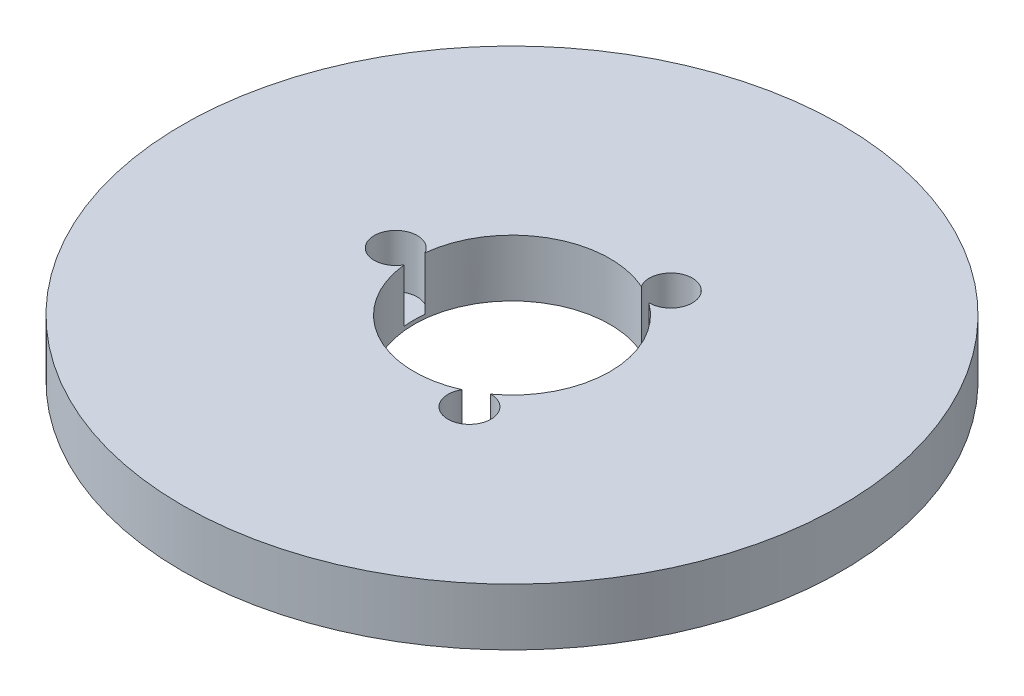
ISO-10303-21;
HEADER;
FILE_DESCRIPTION(('STEP AP214'),'2;1');
FILE_NAME('part.step','',(''),(''),'','','');
FILE_SCHEMA(('AUTOMOTIVE_DESIGN { 1 0 10303 214 1 1 1 1 }'));
ENDSEC;
DATA;
#1=APPLICATION_CONTEXT('core data for automotive mechanical design processes');
#2=APPLICATION_PROTOCOL_DEFINITION('international standard','automotive_design',2000,#1);
#3=PRODUCT_CONTEXT('',#1,'mechanical');
#4=PRODUCT('Part','Part','',(#3));
#5=PRODUCT_RELATED_PRODUCT_CATEGORY('part','',(#4));
#6=PRODUCT_DEFINITION_FORMATION('','',#4);
#7=PRODUCT_DEFINITION_CONTEXT('part definition',#1,'design');
#8=PRODUCT_DEFINITION('design','',#6,#7);
#9=PRODUCT_DEFINITION_SHAPE('','',#8);
#10=(LENGTH_UNIT() NAMED_UNIT(*) SI_UNIT(.MILLI.,.METRE.));
#11=(NAMED_UNIT(*) PLANE_ANGLE_UNIT() SI_UNIT($,.RADIAN.));
#12=(NAMED_UNIT(*) SI_UNIT($,.STERADIAN.) SOLID_ANGLE_UNIT());
#13=UNCERTAINTY_MEASURE_WITH_UNIT(LENGTH_MEASURE(1.E-05),#10,'distance_accuracy_value','');
#14=(GEOMETRIC_REPRESENTATION_CONTEXT(3) GLOBAL_UNCERTAINTY_ASSIGNED_CONTEXT((#13)) GLOBAL_UNIT_ASSIGNED_CONTEXT((#10,
#11,#12)) REPRESENTATION_CONTEXT('',''));
#15=CARTESIAN_POINT('',(0.,0.,0.));
#16=DIRECTION('',(0.,0.,1.));
#17=DIRECTION('',(1.,0.,0.));
#18=AXIS2_PLACEMENT_3D('',#15,#16,#17);
#19=CARTESIAN_POINT('',(0.,16.,0.));
#20=DIRECTION('',(0.,-1.,0.));
#21=DIRECTION('',(0.,0.,-1.));
#22=AXIS2_PLACEMENT_3D('',#19,#20,#21);
#23=CYLINDRICAL_SURFACE('',#22,92.5);
#24=CARTESIAN_POINT('',(0.,16.,0.));
#25=DIRECTION('',(0.,1.,0.));
#26=DIRECTION('',(0.,0.,1.));
#27=AXIS2_PLACEMENT_3D('',#24,#25,#26);
#28=CIRCLE('',#27,92.5);
#29=CARTESIAN_POINT('',(0.,16.,92.5));
#30=VERTEX_POINT('',#29);
#31=EDGE_CURVE('E126',#30,#30,#28,.T.);
#32=ORIENTED_EDGE('',*,*,#31,.F.);
#33=EDGE_LOOP('',(#32));
#34=FACE_BOUND('',#33,.T.);
#35=CARTESIAN_POINT('',(0.,0.,0.));
#36=DIRECTION('',(0.,1.,0.));
#37=DIRECTION('',(0.,0.,1.));
#38=AXIS2_PLACEMENT_3D('',#35,#36,#37);
#39=CIRCLE('',#38,92.5);
#40=CARTESIAN_POINT('',(0.,0.,92.5));
#41=VERTEX_POINT('',#40);
#42=EDGE_CURVE('E124',#41,#41,#39,.T.);
#43=ORIENTED_EDGE('',*,*,#42,.T.);
#44=EDGE_LOOP('',(#43));
#45=FACE_BOUND('',#44,.T.);
#46=ADVANCED_FACE('F39',(#34,#45),#23,.T.);
#47=CARTESIAN_POINT('',(0.,16.,0.));
#48=DIRECTION('',(0.,1.,0.));
#49=DIRECTION('',(0.,0.,1.));
#50=AXIS2_PLACEMENT_3D('',#47,#48,#49);
#51=PLANE('',#50);
#52=CARTESIAN_POINT('',(16.3174792293362,16.,28.2627030766599));
#53=DIRECTION('',(0.,1.,0.));
#54=DIRECTION('',(0.866025403784436,0.,-0.500000000000004));
#55=AXIS2_PLACEMENT_3D('',#52,#53,#54);
#56=CIRCLE('',#55,6.04727250579016);
#57=CARTESIAN_POINT('',(11.1362899057225,16.,25.1442448114017));
#58=VERTEX_POINT('',#57);
#59=CARTESIAN_POINT('',(16.2074098127879,16.,22.2164323679646));
#60=VERTEX_POINT('',#59);
#61=EDGE_CURVE('E147',#58,#60,#56,.T.);
#62=ORIENTED_EDGE('',*,*,#61,.F.);
#63=CARTESIAN_POINT('',(0.,16.,0.));
#64=DIRECTION('',(0.,1.,0.));
#65=DIRECTION('',(0.,0.,1.));
#66=AXIS2_PLACEMENT_3D('',#63,#64,#65);
#67=CIRCLE('',#66,27.5);
#68=CARTESIAN_POINT('',(-27.3436997185102,16.,2.92781244343707));
#69=VERTEX_POINT('',#68);
#70=EDGE_CURVE('E118',#69,#58,#67,.T.);
#71=ORIENTED_EDGE('',*,*,#70,.F.);
#72=CARTESIAN_POINT('',(-32.6349584586722,16.,0.));
#73=DIRECTION('',(0.,1.,0.));
#74=DIRECTION('',(0.,0.,1.));
#75=AXIS2_PLACEMENT_3D('',#72,#73,#74);
#76=CIRCLE('',#75,6.04727250579016);
#77=CARTESIAN_POINT('',(-27.3436997185102,16.,-2.92781244343707));
#78=VERTEX_POINT('',#77);
#79=EDGE_CURVE('E113',#78,#69,#76,.T.);
#80=ORIENTED_EDGE('',*,*,#79,.F.);
#81=CARTESIAN_POINT('',(11.1362899057222,16.,-25.1442448114019));
#82=VERTEX_POINT('',#81);
#83=EDGE_CURVE('E106',#82,#78,#67,.T.);
#84=ORIENTED_EDGE('',*,*,#83,.F.);
#85=CARTESIAN_POINT('',(16.3174792293358,16.,-28.2627030766601));
#86=DIRECTION('',(0.,1.,0.));
#87=DIRECTION('',(-0.866025403784443,0.,-0.499999999999992));
#88=AXIS2_PLACEMENT_3D('',#85,#86,#87);
#89=CIRCLE('',#88,6.04727250579016);
#90=CARTESIAN_POINT('',(16.2074098127876,16.,-22.2164323679649));
#91=VERTEX_POINT('',#90);
#92=EDGE_CURVE('E90',#91,#82,#89,.T.);
#93=ORIENTED_EDGE('',*,*,#92,.F.);
#94=EDGE_CURVE('E116',#60,#91,#67,.T.);
#95=ORIENTED_EDGE('',*,*,#94,.F.);
#96=EDGE_LOOP('',(#62,#71,#80,#84,#93,#95));
#97=FACE_BOUND('',#96,.T.);
#98=ORIENTED_EDGE('',*,*,#31,.T.);
#99=EDGE_LOOP('',(#98));
#100=FACE_BOUND('',#99,.T.);
#101=ADVANCED_FACE('F115',(#97,#100),#51,.T.);
#102=CARTESIAN_POINT('',(0.,0.,0.));
#103=DIRECTION('',(0.,1.,0.));
#104=DIRECTION('',(0.,0.,1.));
#105=AXIS2_PLACEMENT_3D('',#102,#103,#104);
#106=PLANE('',#105);
#107=CARTESIAN_POINT('',(0.,0.,0.));
#108=DIRECTION('',(0.,1.,0.));
#109=DIRECTION('',(0.,0.,1.));
#110=AXIS2_PLACEMENT_3D('',#107,#108,#109);
#111=CIRCLE('',#110,27.5);
#112=CARTESIAN_POINT('',(0.,0.,27.5));
#113=VERTEX_POINT('',#112);
#114=EDGE_CURVE('E120',#113,#113,#111,.T.);
#115=ORIENTED_EDGE('',*,*,#114,.T.);
#116=EDGE_LOOP('',(#115));
#117=FACE_BOUND('',#116,.T.);
#118=ORIENTED_EDGE('',*,*,#42,.F.);
#119=EDGE_LOOP('',(#118));
#120=FACE_BOUND('',#119,.T.);
#121=ADVANCED_FACE('F164',(#117,#120),#106,.F.);
#122=CARTESIAN_POINT('',(0.,16.,0.));
#123=DIRECTION('',(0.,-1.,0.));
#124=DIRECTION('',(0.,0.,-1.));
#125=AXIS2_PLACEMENT_3D('',#122,#123,#124);
#126=CYLINDRICAL_SURFACE('',#125,27.5);
#127=DIRECTION('',(0.,1.,0.));
#128=VECTOR('',#127,1.);
#129=CARTESIAN_POINT('',(11.1362899057225,8.53697431034146,25.1442448114017));
#130=LINE('',#129,#128);
#131=CARTESIAN_POINT('',(11.1362899057225,1.07394862068291,25.1442448114017));
#132=VERTEX_POINT('',#131);
#133=EDGE_CURVE('E11',#132,#58,#130,.T.);
#134=ORIENTED_EDGE('',*,*,#133,.F.);
#135=CARTESIAN_POINT('',(0.,1.07394862068291,0.));
#136=DIRECTION('',(0.,1.,0.));
#137=DIRECTION('',(0.,0.,1.));
#138=AXIS2_PLACEMENT_3D('',#135,#136,#137);
#139=CIRCLE('',#138,27.5);
#140=CARTESIAN_POINT('',(16.2074098127879,1.07394862068291,22.2164323679646));
#141=VERTEX_POINT('',#140);
#142=EDGE_CURVE('E144',#132,#141,#139,.T.);
#143=ORIENTED_EDGE('',*,*,#142,.T.);
#144=DIRECTION('',(0.,1.,0.));
#145=VECTOR('',#144,1.);
#146=CARTESIAN_POINT('',(16.2074098127879,8.53697431034146,22.2164323679646));
#147=LINE('',#146,#145);
#148=EDGE_CURVE('E46',#60,#141,#147,.F.);
#149=ORIENTED_EDGE('',*,*,#148,.F.);
#150=ORIENTED_EDGE('',*,*,#94,.T.);
#151=DIRECTION('',(0.,1.,0.));
#152=VECTOR('',#151,1.);
#153=CARTESIAN_POINT('',(16.2074098127876,8.53697431034146,-22.2164323679649));
#154=LINE('',#153,#152);
#155=CARTESIAN_POINT('',(16.2074098127876,1.07394862068291,-22.2164323679649));
#156=VERTEX_POINT('',#155);
#157=EDGE_CURVE('E92',#156,#91,#154,.T.);
#158=ORIENTED_EDGE('',*,*,#157,.F.);
#159=CARTESIAN_POINT('',(0.,1.07394862068291,0.));
#160=DIRECTION('',(0.,1.,0.));
#161=DIRECTION('',(0.,0.,1.));
#162=AXIS2_PLACEMENT_3D('',#159,#160,#161);
#163=CIRCLE('',#162,27.5);
#164=CARTESIAN_POINT('',(11.1362899057222,1.07394862068291,-25.1442448114019));
#165=VERTEX_POINT('',#164);
#166=EDGE_CURVE('E107',#156,#165,#163,.T.);
#167=ORIENTED_EDGE('',*,*,#166,.T.);
#168=DIRECTION('',(0.,1.,0.));
#169=VECTOR('',#168,1.);
#170=CARTESIAN_POINT('',(11.1362899057222,8.53697431034146,-25.1442448114019));
#171=LINE('',#170,#169);
#172=EDGE_CURVE('E95',#82,#165,#171,.F.);
#173=ORIENTED_EDGE('',*,*,#172,.F.);
#174=ORIENTED_EDGE('',*,*,#83,.T.);
#175=DIRECTION('',(0.,1.,0.));
#176=VECTOR('',#175,1.);
#177=CARTESIAN_POINT('',(-27.3436997185102,8.53697431034146,-2.92781244343707));
#178=LINE('',#177,#176);
#179=CARTESIAN_POINT('',(-27.3436997185102,1.07394862068291,-2.92781244343707));
#180=VERTEX_POINT('',#179);
#181=EDGE_CURVE('E143',#180,#78,#178,.T.);
#182=ORIENTED_EDGE('',*,*,#181,.F.);
#183=CARTESIAN_POINT('',(0.,1.07394862068291,0.));
#184=DIRECTION('',(0.,1.,0.));
#185=DIRECTION('',(0.,0.,1.));
#186=AXIS2_PLACEMENT_3D('',#183,#184,#185);
#187=CIRCLE('',#186,27.5);
#188=CARTESIAN_POINT('',(-27.3436997185102,1.07394862068291,2.92781244343707));
#189=VERTEX_POINT('',#188);
#190=EDGE_CURVE('E132',#180,#189,#187,.T.);
#191=ORIENTED_EDGE('',*,*,#190,.T.);
#192=DIRECTION('',(0.,1.,0.));
#193=VECTOR('',#192,1.);
#194=CARTESIAN_POINT('',(-27.3436997185102,8.53697431034146,2.92781244343707));
#195=LINE('',#194,#193);
#196=EDGE_CURVE('E137',#69,#189,#195,.F.);
#197=ORIENTED_EDGE('',*,*,#196,.F.);
#198=ORIENTED_EDGE('',*,*,#70,.T.);
#199=EDGE_LOOP('',(#134,#143,#149,#150,#158,#167,#173,#174,#182,#191,#197,#198));
#200=FACE_BOUND('',#199,.T.);
#201=ORIENTED_EDGE('',*,*,#114,.F.);
#202=EDGE_LOOP('',(#201));
#203=FACE_BOUND('',#202,.T.);
#204=ADVANCED_FACE('F103',(#200,#203),#126,.F.);
#205=CARTESIAN_POINT('',(-32.6349584586722,1.07394862068291,0.));
#206=DIRECTION('',(0.,1.,0.));
#207=DIRECTION('',(0.,0.,1.));
#208=AXIS2_PLACEMENT_3D('',#205,#206,#207);
#209=CYLINDRICAL_SURFACE('',#208,6.04727250579016);
#210=ORIENTED_EDGE('',*,*,#181,.T.);
#211=ORIENTED_EDGE('',*,*,#79,.T.);
#212=ORIENTED_EDGE('',*,*,#196,.T.);
#213=CARTESIAN_POINT('',(-32.6349584586722,1.07394862068291,0.));
#214=DIRECTION('',(0.,1.,0.));
#215=DIRECTION('',(0.,0.,1.));
#216=AXIS2_PLACEMENT_3D('',#213,#214,#215);
#217=CIRCLE('',#216,6.04727250579016);
#218=EDGE_CURVE('E121',#180,#189,#217,.T.);
#219=ORIENTED_EDGE('',*,*,#218,.F.);
#220=EDGE_LOOP('',(#210,#211,#212,#219));
#221=FACE_BOUND('',#220,.T.);
#222=ADVANCED_FACE('F174',(#221),#209,.F.);
#223=CARTESIAN_POINT('',(-32.6349584586722,1.07394862068291,0.));
#224=DIRECTION('',(0.,1.,0.));
#225=DIRECTION('',(0.,0.,1.));
#226=AXIS2_PLACEMENT_3D('',#223,#224,#225);
#227=PLANE('',#226);
#228=ORIENTED_EDGE('',*,*,#218,.T.);
#229=ORIENTED_EDGE('',*,*,#190,.F.);
#230=EDGE_LOOP('',(#228,#229));
#231=FACE_BOUND('',#230,.T.);
#232=ADVANCED_FACE('F177',(#231),#227,.T.);
#233=CARTESIAN_POINT('',(16.3174792293358,1.07394862068291,-28.2627030766601));
#234=DIRECTION('',(0.,1.,0.));
#235=DIRECTION('',(0.,0.,1.));
#236=AXIS2_PLACEMENT_3D('',#233,#234,#235);
#237=CYLINDRICAL_SURFACE('',#236,6.04727250579016);
#238=ORIENTED_EDGE('',*,*,#157,.T.);
#239=ORIENTED_EDGE('',*,*,#92,.T.);
#240=ORIENTED_EDGE('',*,*,#172,.T.);
#241=CARTESIAN_POINT('',(16.3174792293358,1.07394862068291,-28.2627030766601));
#242=DIRECTION('',(0.,1.,0.));
#243=DIRECTION('',(-0.866025403784443,0.,-0.499999999999992));
#244=AXIS2_PLACEMENT_3D('',#241,#242,#243);
#245=CIRCLE('',#244,6.04727250579016);
#246=EDGE_CURVE('E56',#156,#165,#245,.T.);
#247=ORIENTED_EDGE('',*,*,#246,.F.);
#248=EDGE_LOOP('',(#238,#239,#240,#247));
#249=FACE_BOUND('',#248,.T.);
#250=ADVANCED_FACE('F93',(#249),#237,.F.);
#251=CARTESIAN_POINT('',(16.3174792293358,1.07394862068291,-28.2627030766601));
#252=DIRECTION('',(0.,1.,0.));
#253=DIRECTION('',(-0.866025403784443,0.,-0.499999999999992));
#254=AXIS2_PLACEMENT_3D('',#251,#252,#253);
#255=PLANE('',#254);
#256=ORIENTED_EDGE('',*,*,#246,.T.);
#257=ORIENTED_EDGE('',*,*,#166,.F.);
#258=EDGE_LOOP('',(#256,#257));
#259=FACE_BOUND('',#258,.T.);
#260=ADVANCED_FACE('F160',(#259),#255,.T.);
#261=CARTESIAN_POINT('',(16.3174792293362,1.07394862068291,28.2627030766599));
#262=DIRECTION('',(0.,1.,0.));
#263=DIRECTION('',(0.,0.,1.));
#264=AXIS2_PLACEMENT_3D('',#261,#262,#263);
#265=CYLINDRICAL_SURFACE('',#264,6.04727250579016);
#266=ORIENTED_EDGE('',*,*,#133,.T.);
#267=ORIENTED_EDGE('',*,*,#61,.T.);
#268=ORIENTED_EDGE('',*,*,#148,.T.);
#269=CARTESIAN_POINT('',(16.3174792293362,1.07394862068291,28.2627030766599));
#270=DIRECTION('',(0.,1.,0.));
#271=DIRECTION('',(0.866025403784436,0.,-0.500000000000004));
#272=AXIS2_PLACEMENT_3D('',#269,#270,#271);
#273=CIRCLE('',#272,6.04727250579016);
#274=EDGE_CURVE('E55',#132,#141,#273,.T.);
#275=ORIENTED_EDGE('',*,*,#274,.F.);
#276=EDGE_LOOP('',(#266,#267,#268,#275));
#277=FACE_BOUND('',#276,.T.);
#278=ADVANCED_FACE('F149',(#277),#265,.F.);
#279=CARTESIAN_POINT('',(16.3174792293362,1.07394862068291,28.2627030766599));
#280=DIRECTION('',(0.,1.,0.));
#281=DIRECTION('',(0.866025403784436,0.,-0.500000000000004));
#282=AXIS2_PLACEMENT_3D('',#279,#280,#281);
#283=PLANE('',#282);
#284=ORIENTED_EDGE('',*,*,#274,.T.);
#285=ORIENTED_EDGE('',*,*,#142,.F.);
#286=EDGE_LOOP('',(#284,#285));
#287=FACE_BOUND('',#286,.T.);
#288=ADVANCED_FACE('F151',(#287),#283,.T.);
#289=CLOSED_SHELL('',(#46,#101,#121,#204,#222,#232,#250,#260,#278,#288));
#290=MANIFOLD_SOLID_BREP('B2',#289);
#291=ADVANCED_BREP_SHAPE_REPRESENTATION('',(#18,#290),#14);
#292=SHAPE_DEFINITION_REPRESENTATION(#9,#291);
ENDSEC;
END-ISO-10303-21;
